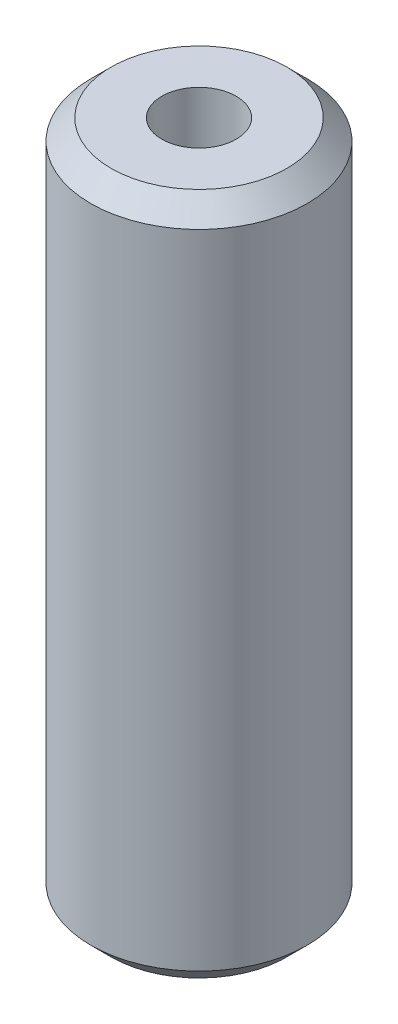
ISO-10303-21;
HEADER;
FILE_DESCRIPTION(('STEP AP214'),'2;1');
FILE_NAME('part.step','',(''),(''),'','','');
FILE_SCHEMA(('AUTOMOTIVE_DESIGN { 1 0 10303 214 1 1 1 1 }'));
ENDSEC;
DATA;
#1=APPLICATION_CONTEXT('core data for automotive mechanical design processes');
#2=APPLICATION_PROTOCOL_DEFINITION('international standard','automotive_design',2000,#1);
#3=PRODUCT_CONTEXT('',#1,'mechanical');
#4=PRODUCT('Part','Part','',(#3));
#5=PRODUCT_RELATED_PRODUCT_CATEGORY('part','',(#4));
#6=PRODUCT_DEFINITION_FORMATION('','',#4);
#7=PRODUCT_DEFINITION_CONTEXT('part definition',#1,'design');
#8=PRODUCT_DEFINITION('design','',#6,#7);
#9=PRODUCT_DEFINITION_SHAPE('','',#8);
#10=(LENGTH_UNIT() NAMED_UNIT(*) SI_UNIT(.MILLI.,.METRE.));
#11=(NAMED_UNIT(*) PLANE_ANGLE_UNIT() SI_UNIT($,.RADIAN.));
#12=(NAMED_UNIT(*) SI_UNIT($,.STERADIAN.) SOLID_ANGLE_UNIT());
#13=UNCERTAINTY_MEASURE_WITH_UNIT(LENGTH_MEASURE(1.E-05),#10,'distance_accuracy_value','');
#14=(GEOMETRIC_REPRESENTATION_CONTEXT(3) GLOBAL_UNCERTAINTY_ASSIGNED_CONTEXT((#13)) GLOBAL_UNIT_ASSIGNED_CONTEXT((#10,
#11,#12)) REPRESENTATION_CONTEXT('',''));
#15=CARTESIAN_POINT('',(0.,0.,0.));
#16=DIRECTION('',(0.,0.,1.));
#17=DIRECTION('',(1.,0.,0.));
#18=AXIS2_PLACEMENT_3D('',#15,#16,#17);
#19=CARTESIAN_POINT('',(0.,94.7057697395088,0.));
#20=DIRECTION('',(0.,-1.,0.));
#21=DIRECTION('',(0.,0.,-1.));
#22=AXIS2_PLACEMENT_3D('',#19,#20,#21);
#23=CYLINDRICAL_SURFACE('',#22,15.);
#24=CARTESIAN_POINT('',(0.,91.890636631154,0.));
#25=DIRECTION('',(0.,1.,0.));
#26=DIRECTION('',(0.,0.,1.));
#27=AXIS2_PLACEMENT_3D('',#24,#25,#26);
#28=CIRCLE('',#27,15.);
#29=CARTESIAN_POINT('',(0.,91.890636631154,15.));
#30=VERTEX_POINT('',#29);
#31=EDGE_CURVE('E50',#30,#30,#28,.F.);
#32=ORIENTED_EDGE('',*,*,#31,.T.);
#33=EDGE_LOOP('',(#32));
#34=FACE_BOUND('',#33,.T.);
#35=CARTESIAN_POINT('',(0.,2.81513310835481,0.));
#36=DIRECTION('',(0.,1.,0.));
#37=DIRECTION('',(0.,0.,1.));
#38=AXIS2_PLACEMENT_3D('',#35,#36,#37);
#39=CIRCLE('',#38,15.);
#40=CARTESIAN_POINT('',(0.,2.81513310835481,15.));
#41=VERTEX_POINT('',#40);
#42=EDGE_CURVE('E51',#41,#41,#39,.T.);
#43=ORIENTED_EDGE('',*,*,#42,.T.);
#44=EDGE_LOOP('',(#43));
#45=FACE_BOUND('',#44,.T.);
#46=ADVANCED_FACE('F39',(#34,#45),#23,.T.);
#47=CARTESIAN_POINT('',(0.,94.7057697395088,0.));
#48=DIRECTION('',(0.,1.,0.));
#49=DIRECTION('',(0.,0.,1.));
#50=AXIS2_PLACEMENT_3D('',#47,#48,#49);
#51=PLANE('',#50);
#52=CARTESIAN_POINT('',(0.,94.7057697395088,0.));
#53=DIRECTION('',(0.,1.,0.));
#54=DIRECTION('',(0.,0.,1.));
#55=AXIS2_PLACEMENT_3D('',#52,#53,#54);
#56=CIRCLE('',#55,12.1848668916452);
#57=CARTESIAN_POINT('',(0.,94.7057697395088,12.1848668916452));
#58=VERTEX_POINT('',#57);
#59=EDGE_CURVE('E54',#58,#58,#56,.T.);
#60=ORIENTED_EDGE('',*,*,#59,.T.);
#61=EDGE_LOOP('',(#60));
#62=FACE_BOUND('',#61,.T.);
#63=CARTESIAN_POINT('',(0.,94.7057697395088,0.));
#64=DIRECTION('',(0.,1.,0.));
#65=DIRECTION('',(0.,0.,1.));
#66=AXIS2_PLACEMENT_3D('',#63,#64,#65);
#67=CIRCLE('',#66,5.16456795168508);
#68=CARTESIAN_POINT('',(0.,94.7057697395088,5.16456795168508));
#69=VERTEX_POINT('',#68);
#70=EDGE_CURVE('E58',#69,#69,#67,.T.);
#71=ORIENTED_EDGE('',*,*,#70,.F.);
#72=EDGE_LOOP('',(#71));
#73=FACE_BOUND('',#72,.T.);
#74=ADVANCED_FACE('F69',(#62,#73),#51,.T.);
#75=CARTESIAN_POINT('',(0.,0.,0.));
#76=DIRECTION('',(0.,1.,0.));
#77=DIRECTION('',(0.,0.,1.));
#78=AXIS2_PLACEMENT_3D('',#75,#76,#77);
#79=PLANE('',#78);
#80=CARTESIAN_POINT('',(0.,0.,0.));
#81=DIRECTION('',(0.,1.,0.));
#82=DIRECTION('',(0.,0.,1.));
#83=AXIS2_PLACEMENT_3D('',#80,#81,#82);
#84=CIRCLE('',#83,12.1848668916452);
#85=CARTESIAN_POINT('',(0.,0.,12.1848668916452));
#86=VERTEX_POINT('',#85);
#87=EDGE_CURVE('E10',#86,#86,#84,.F.);
#88=ORIENTED_EDGE('',*,*,#87,.T.);
#89=EDGE_LOOP('',(#88));
#90=FACE_BOUND('',#89,.T.);
#91=CARTESIAN_POINT('',(0.,0.,0.));
#92=DIRECTION('',(0.,1.,0.));
#93=DIRECTION('',(0.,0.,1.));
#94=AXIS2_PLACEMENT_3D('',#91,#92,#93);
#95=CIRCLE('',#94,5.16456795168508);
#96=CARTESIAN_POINT('',(0.,0.,5.16456795168508));
#97=VERTEX_POINT('',#96);
#98=EDGE_CURVE('E63',#97,#97,#95,.T.);
#99=ORIENTED_EDGE('',*,*,#98,.T.);
#100=EDGE_LOOP('',(#99));
#101=FACE_BOUND('',#100,.T.);
#102=ADVANCED_FACE('F75',(#90,#101),#79,.F.);
#103=CARTESIAN_POINT('',(0.,94.7057697395088,0.));
#104=DIRECTION('',(0.,-1.,0.));
#105=DIRECTION('',(0.,0.,-1.));
#106=AXIS2_PLACEMENT_3D('',#103,#104,#105);
#107=CYLINDRICAL_SURFACE('',#106,5.16456795168508);
#108=ORIENTED_EDGE('',*,*,#70,.T.);
#109=EDGE_LOOP('',(#108));
#110=FACE_BOUND('',#109,.T.);
#111=ORIENTED_EDGE('',*,*,#98,.F.);
#112=EDGE_LOOP('',(#111));
#113=FACE_BOUND('',#112,.T.);
#114=ADVANCED_FACE('F70',(#110,#113),#107,.F.);
#115=CARTESIAN_POINT('',(0.,94.7057697395088,0.));
#116=DIRECTION('',(0.,-1.,0.));
#117=DIRECTION('',(0.,0.,-1.));
#118=AXIS2_PLACEMENT_3D('',#115,#116,#117);
#119=CONICAL_SURFACE('',#118,12.1848668916452,0.785398163397446);
#120=ORIENTED_EDGE('',*,*,#31,.F.);
#121=EDGE_LOOP('',(#120));
#122=FACE_BOUND('',#121,.T.);
#123=ORIENTED_EDGE('',*,*,#59,.F.);
#124=EDGE_LOOP('',(#123));
#125=FACE_BOUND('',#124,.T.);
#126=ADVANCED_FACE('F81',(#122,#125),#119,.T.);
#127=CARTESIAN_POINT('',(0.,2.81513310835481,0.));
#128=DIRECTION('',(0.,1.,0.));
#129=DIRECTION('',(0.,0.,1.));
#130=AXIS2_PLACEMENT_3D('',#127,#128,#129);
#131=CONICAL_SURFACE('',#130,15.,0.785398163397452);
#132=CARTESIAN_POINT('',(0.,0.,12.1848668916452));
#133=CARTESIAN_POINT('',(0.,0.029324303212029,12.2141911948572));
#134=CARTESIAN_POINT('',(0.,0.0586486064240582,12.2435154980692));
#135=CARTESIAN_POINT('',(0.,0.117297212848117,12.3021641044933));
#136=CARTESIAN_POINT('',(0.,0.146621516060146,12.3314884077053));
#137=CARTESIAN_POINT('',(0.,0.205270122484204,12.3901370141294));
#138=CARTESIAN_POINT('',(0.,0.234594425696233,12.4194613173414));
#139=CARTESIAN_POINT('',(0.,0.293243032120292,12.4781099237655));
#140=CARTESIAN_POINT('',(0.,0.322567335332322,12.5074342269775));
#141=CARTESIAN_POINT('',(0.,0.38121594175638,12.5660828334016));
#142=CARTESIAN_POINT('',(0.,0.410540244968409,12.5954071366136));
#143=CARTESIAN_POINT('',(0.,0.469188851392468,12.6540557430376));
#144=CARTESIAN_POINT('',(0.,0.498513154604497,12.6833800462497));
#145=CARTESIAN_POINT('',(0.,0.557161761028556,12.7420286526737));
#146=CARTESIAN_POINT('',(0.,0.586486064240585,12.7713529558858));
#147=CARTESIAN_POINT('',(0.,0.645134670664643,12.8300015623098));
#148=CARTESIAN_POINT('',(0.,0.674458973876673,12.8593258655218));
#149=CARTESIAN_POINT('',(0.,0.733107580300731,12.9179744719459));
#150=CARTESIAN_POINT('',(0.,0.76243188351276,12.9472987751579));
#151=CARTESIAN_POINT('',(0.,0.821080489936819,13.005947381582));
#152=CARTESIAN_POINT('',(0.,0.850404793148848,13.035271684794));
#153=CARTESIAN_POINT('',(0.,0.909053399572906,13.0939202912181));
#154=CARTESIAN_POINT('',(0.,0.938377702784936,13.1232445944301));
#155=CARTESIAN_POINT('',(0.,0.997026309208994,13.1818932008542));
#156=CARTESIAN_POINT('',(0.,1.02635061242102,13.2112175040662));
#157=CARTESIAN_POINT('',(0.,1.08499921884508,13.2698661104903));
#158=CARTESIAN_POINT('',(0.,1.11432352205711,13.2991904137023));
#159=CARTESIAN_POINT('',(0.,1.17297212848117,13.3578390201263));
#160=CARTESIAN_POINT('',(0.,1.2022964316932,13.3871633233384));
#161=CARTESIAN_POINT('',(0.,1.26094503811726,13.4458119297624));
#162=CARTESIAN_POINT('',(0.,1.29026934132929,13.4751362329745));
#163=CARTESIAN_POINT('',(0.,1.34891794775335,13.5337848393985));
#164=CARTESIAN_POINT('',(0.,1.37824225096537,13.5631091426106));
#165=CARTESIAN_POINT('',(0.,1.43689085738943,13.6217577490346));
#166=CARTESIAN_POINT('',(0.,1.46621516060146,13.6510820522466));
#167=CARTESIAN_POINT('',(0.,1.52486376702552,13.7097306586707));
#168=CARTESIAN_POINT('',(0.,1.55418807023755,13.7390549618827));
#169=CARTESIAN_POINT('',(0.,1.61283667666161,13.7977035683068));
#170=CARTESIAN_POINT('',(0.,1.64216097987364,13.8270278715188));
#171=CARTESIAN_POINT('',(0.,1.7008095862977,13.8856764779429));
#172=CARTESIAN_POINT('',(0.,1.73013388950973,13.9150007811549));
#173=CARTESIAN_POINT('',(0.,1.78878249593378,13.973649387579));
#174=CARTESIAN_POINT('',(0.,1.81810679914581,14.002973690791));
#175=CARTESIAN_POINT('',(0.,1.87675540556987,14.0616222972151));
#176=CARTESIAN_POINT('',(0.,1.9060797087819,14.0909466004271));
#177=CARTESIAN_POINT('',(0.,1.96472831520596,14.1495952068511));
#178=CARTESIAN_POINT('',(0.,1.99405261841799,14.1789195100632));
#179=CARTESIAN_POINT('',(0.,2.05270122484205,14.2375681164872));
#180=CARTESIAN_POINT('',(0.,2.08202552805408,14.2668924196993));
#181=CARTESIAN_POINT('',(0.,2.14067413447814,14.3255410261233));
#182=CARTESIAN_POINT('',(0.,2.16999843769016,14.3548653293354));
#183=CARTESIAN_POINT('',(0.,2.22864704411422,14.4135139357594));
#184=CARTESIAN_POINT('',(0.,2.25797134732625,14.4428382389714));
#185=CARTESIAN_POINT('',(0.,2.31661995375031,14.5014868453955));
#186=CARTESIAN_POINT('',(0.,2.34594425696234,14.5308111486075));
#187=CARTESIAN_POINT('',(0.,2.4045928633864,14.5894597550316));
#188=CARTESIAN_POINT('',(0.,2.43391716659843,14.6187840582436));
#189=CARTESIAN_POINT('',(0.,2.49256577302249,14.6774326646677));
#190=CARTESIAN_POINT('',(0.,2.52189007623452,14.7067569678797));
#191=CARTESIAN_POINT('',(0.,2.58053868265857,14.7654055743038));
#192=CARTESIAN_POINT('',(0.,2.6098629858706,14.7947298775158));
#193=CARTESIAN_POINT('',(0.,2.66851159229466,14.8533784839399));
#194=CARTESIAN_POINT('',(0.,2.69783589550669,14.8827027871519));
#195=CARTESIAN_POINT('',(0.,2.75648450193075,14.9413513935759));
#196=CARTESIAN_POINT('',(0.,2.78580880514278,14.970675696788));
#197=CARTESIAN_POINT('',(0.,2.81513310835481,15.));
#198=B_SPLINE_CURVE_WITH_KNOTS('',3,(#132,#133,#134,#135,#136,#137,#138,#139,#140,#141,#142,
#143,#144,#145,#146,#147,#148,#149,#150,#151,#152,#153,#154,#155,#156,#157,#158,#159,#160,#161,
#162,#163,#164,#165,#166,#167,#168,#169,#170,#171,#172,#173,#174,#175,#176,#177,#178,#179,#180,
#181,#182,#183,#184,#185,#186,#187,#188,#189,#190,#191,#192,#193,#194,#195,#196,#197),
.UNSPECIFIED.,.F.,.F.,(4,2,2,2,2,2,2,2,2,2,2,2,2,2,2,2,2,2,2,2,2,2,2,2,2,2,2,2,2,2,2,2,4),(0.,
0.124412481928778,0.248824963857557,0.373237445786336,0.497649927715113,0.622062409643892,
0.74647489157267,0.870887373501449,0.995299855430227,1.11971233735901,1.24412481928778,
1.36853730121656,1.49294978314534,1.61736226507412,1.7417747470029,1.86618722893168,
1.99059971086046,2.11501219278923,2.23942467471801,2.36383715664679,2.48824963857557,
2.61266212050435,2.73707460243313,2.86148708436191,2.98589956629068,3.11031204821946,
3.23472453014824,3.35913701207702,3.4835494940058,3.60796197593458,3.73237445786335,
3.85678693979213,3.98119942172091),.UNSPECIFIED.);
#199=EDGE_CURVE('BSEAM45',#86,#41,#198,.T.);
#200=ORIENTED_EDGE('',*,*,#87,.F.);
#201=ORIENTED_EDGE('',*,*,#42,.F.);
#202=ORIENTED_EDGE('',*,*,#199,.T.);
#203=ORIENTED_EDGE('',*,*,#199,.F.);
#204=EDGE_LOOP('',(#200,#202,#201,#203));
#205=FACE_BOUND('',#204,.T.);
#206=ADVANCED_FACE('F45',(#205),#131,.T.);
#207=CLOSED_SHELL('',(#46,#74,#102,#114,#126,#206));
#208=MANIFOLD_SOLID_BREP('B2',#207);
#209=ADVANCED_BREP_SHAPE_REPRESENTATION('',(#18,#208),#14);
#210=SHAPE_DEFINITION_REPRESENTATION(#9,#209);
ENDSEC;
END-ISO-10303-21;
